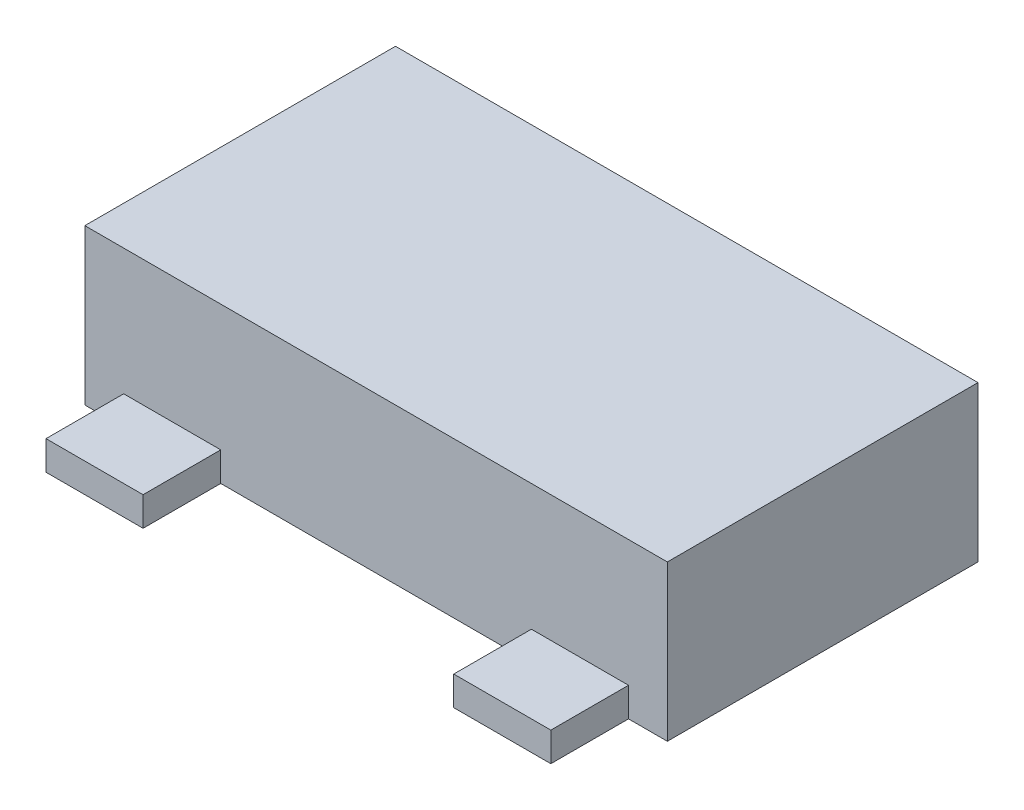
ISO-10303-21;
HEADER;
FILE_DESCRIPTION(('STEP AP214'),'2;1');
FILE_NAME('part.step','',(''),(''),'','','');
FILE_SCHEMA(('AUTOMOTIVE_DESIGN { 1 0 10303 214 1 1 1 1 }'));
ENDSEC;
DATA;
#1=APPLICATION_CONTEXT('core data for automotive mechanical design processes');
#2=APPLICATION_PROTOCOL_DEFINITION('international standard','automotive_design',2000,#1);
#3=PRODUCT_CONTEXT('',#1,'mechanical');
#4=PRODUCT('Part','Part','',(#3));
#5=PRODUCT_RELATED_PRODUCT_CATEGORY('part','',(#4));
#6=PRODUCT_DEFINITION_FORMATION('','',#4);
#7=PRODUCT_DEFINITION_CONTEXT('part definition',#1,'design');
#8=PRODUCT_DEFINITION('design','',#6,#7);
#9=PRODUCT_DEFINITION_SHAPE('','',#8);
#10=(LENGTH_UNIT() NAMED_UNIT(*) SI_UNIT(.MILLI.,.METRE.));
#11=(NAMED_UNIT(*) PLANE_ANGLE_UNIT() SI_UNIT($,.RADIAN.));
#12=(NAMED_UNIT(*) SI_UNIT($,.STERADIAN.) SOLID_ANGLE_UNIT());
#13=UNCERTAINTY_MEASURE_WITH_UNIT(LENGTH_MEASURE(1.E-05),#10,'distance_accuracy_value','');
#14=(GEOMETRIC_REPRESENTATION_CONTEXT(3) GLOBAL_UNCERTAINTY_ASSIGNED_CONTEXT((#13)) GLOBAL_UNIT_ASSIGNED_CONTEXT((#10,
#11,#12)) REPRESENTATION_CONTEXT('',''));
#15=CARTESIAN_POINT('',(0.,0.,0.));
#16=DIRECTION('',(0.,0.,1.));
#17=DIRECTION('',(1.,0.,0.));
#18=AXIS2_PLACEMENT_3D('',#15,#16,#17);
#19=CARTESIAN_POINT('',(-1.5,0.8,0.8));
#20=DIRECTION('',(0.,0.,-1.));
#21=DIRECTION('',(-1.,0.,0.));
#22=AXIS2_PLACEMENT_3D('',#19,#20,#21);
#23=PLANE('',#22);
#24=DIRECTION('',(-1.,0.,0.));
#25=VECTOR('',#24,1.);
#26=CARTESIAN_POINT('',(1.3,0.15,0.8));
#27=LINE('',#26,#25);
#28=CARTESIAN_POINT('',(1.3,0.15,0.8));
#29=VERTEX_POINT('',#28);
#30=CARTESIAN_POINT('',(0.8,0.15,0.8));
#31=VERTEX_POINT('',#30);
#32=EDGE_CURVE('E54',#29,#31,#27,.T.);
#33=ORIENTED_EDGE('',*,*,#32,.F.);
#34=DIRECTION('',(0.,-1.,0.));
#35=VECTOR('',#34,1.);
#36=CARTESIAN_POINT('',(1.3,0.790312423743285,0.8));
#37=LINE('',#36,#35);
#38=CARTESIAN_POINT('',(1.3,0.,0.8));
#39=VERTEX_POINT('',#38);
#40=EDGE_CURVE('E162',#29,#39,#37,.T.);
#41=ORIENTED_EDGE('',*,*,#40,.T.);
#42=DIRECTION('',(1.,0.,0.));
#43=VECTOR('',#42,1.);
#44=CARTESIAN_POINT('',(-1.5,0.,0.8));
#45=LINE('',#44,#43);
#46=CARTESIAN_POINT('',(1.5,0.,0.8));
#47=VERTEX_POINT('',#46);
#48=EDGE_CURVE('E147',#39,#47,#45,.T.);
#49=ORIENTED_EDGE('',*,*,#48,.T.);
#50=DIRECTION('',(0.,-1.,0.));
#51=VECTOR('',#50,1.);
#52=CARTESIAN_POINT('',(1.5,0.8,0.8));
#53=LINE('',#52,#51);
#54=CARTESIAN_POINT('',(1.5,0.8,0.8));
#55=VERTEX_POINT('',#54);
#56=EDGE_CURVE('E249',#55,#47,#53,.T.);
#57=ORIENTED_EDGE('',*,*,#56,.F.);
#58=DIRECTION('',(1.,0.,0.));
#59=VECTOR('',#58,1.);
#60=CARTESIAN_POINT('',(-1.5,0.8,0.8));
#61=LINE('',#60,#59);
#62=CARTESIAN_POINT('',(-1.5,0.8,0.8));
#63=VERTEX_POINT('',#62);
#64=EDGE_CURVE('E247',#63,#55,#61,.T.);
#65=ORIENTED_EDGE('',*,*,#64,.F.);
#66=DIRECTION('',(0.,-1.,0.));
#67=VECTOR('',#66,1.);
#68=CARTESIAN_POINT('',(-1.5,0.8,0.8));
#69=LINE('',#68,#67);
#70=CARTESIAN_POINT('',(-1.5,0.,0.8));
#71=VERTEX_POINT('',#70);
#72=EDGE_CURVE('E258',#63,#71,#69,.T.);
#73=ORIENTED_EDGE('',*,*,#72,.T.);
#74=CARTESIAN_POINT('',(-1.3,0.,0.8));
#75=VERTEX_POINT('',#74);
#76=EDGE_CURVE('E160',#71,#75,#45,.T.);
#77=ORIENTED_EDGE('',*,*,#76,.T.);
#78=DIRECTION('',(0.,-1.,0.));
#79=VECTOR('',#78,1.);
#80=CARTESIAN_POINT('',(-1.3,0.790312423743285,0.8));
#81=LINE('',#80,#79);
#82=CARTESIAN_POINT('',(-1.3,0.15,0.8));
#83=VERTEX_POINT('',#82);
#84=EDGE_CURVE('E205',#83,#75,#81,.T.);
#85=ORIENTED_EDGE('',*,*,#84,.F.);
#86=DIRECTION('',(1.,0.,0.));
#87=VECTOR('',#86,1.);
#88=CARTESIAN_POINT('',(-1.3,0.15,0.8));
#89=LINE('',#88,#87);
#90=CARTESIAN_POINT('',(-0.8,0.15,0.8));
#91=VERTEX_POINT('',#90);
#92=EDGE_CURVE('E191',#83,#91,#89,.T.);
#93=ORIENTED_EDGE('',*,*,#92,.T.);
#94=DIRECTION('',(0.,-1.,0.));
#95=VECTOR('',#94,1.);
#96=CARTESIAN_POINT('',(-0.8,0.790312423743285,0.8));
#97=LINE('',#96,#95);
#98=CARTESIAN_POINT('',(-0.8,0.,0.8));
#99=VERTEX_POINT('',#98);
#100=EDGE_CURVE('E207',#91,#99,#97,.T.);
#101=ORIENTED_EDGE('',*,*,#100,.T.);
#102=CARTESIAN_POINT('',(0.8,0.,0.8));
#103=VERTEX_POINT('',#102);
#104=EDGE_CURVE('E157',#99,#103,#45,.T.);
#105=ORIENTED_EDGE('',*,*,#104,.T.);
#106=DIRECTION('',(0.,-1.,0.));
#107=VECTOR('',#106,1.);
#108=CARTESIAN_POINT('',(0.8,0.790312423743285,0.8));
#109=LINE('',#108,#107);
#110=EDGE_CURVE('E50',#31,#103,#109,.T.);
#111=ORIENTED_EDGE('',*,*,#110,.F.);
#112=EDGE_LOOP('',(#33,#41,#49,#57,#65,#73,#77,#85,#93,#101,#105,#111));
#113=FACE_BOUND('',#112,.T.);
#114=ADVANCED_FACE('F35',(#113),#23,.F.);
#115=CARTESIAN_POINT('',(-1.5,0.8,-0.8));
#116=DIRECTION('',(0.,0.,1.));
#117=DIRECTION('',(1.,0.,0.));
#118=AXIS2_PLACEMENT_3D('',#115,#116,#117);
#119=PLANE('',#118);
#120=DIRECTION('',(0.,-1.,0.));
#121=VECTOR('',#120,1.);
#122=CARTESIAN_POINT('',(0.25,0.15,-0.8));
#123=LINE('',#122,#121);
#124=CARTESIAN_POINT('',(0.25,0.15,-0.8));
#125=VERTEX_POINT('',#124);
#126=CARTESIAN_POINT('',(0.25,0.,-0.8));
#127=VERTEX_POINT('',#126);
#128=EDGE_CURVE('E235',#125,#127,#123,.T.);
#129=ORIENTED_EDGE('',*,*,#128,.F.);
#130=DIRECTION('',(1.,0.,0.));
#131=VECTOR('',#130,1.);
#132=CARTESIAN_POINT('',(-0.25,0.15,-0.8));
#133=LINE('',#132,#131);
#134=CARTESIAN_POINT('',(-0.25,0.15,-0.8));
#135=VERTEX_POINT('',#134);
#136=EDGE_CURVE('E218',#135,#125,#133,.T.);
#137=ORIENTED_EDGE('',*,*,#136,.F.);
#138=DIRECTION('',(0.,-1.,0.));
#139=VECTOR('',#138,1.);
#140=CARTESIAN_POINT('',(-0.25,0.15,-0.8));
#141=LINE('',#140,#139);
#142=CARTESIAN_POINT('',(-0.25,0.,-0.8));
#143=VERTEX_POINT('',#142);
#144=EDGE_CURVE('E237',#135,#143,#141,.T.);
#145=ORIENTED_EDGE('',*,*,#144,.T.);
#146=DIRECTION('',(-1.,0.,0.));
#147=VECTOR('',#146,1.);
#148=CARTESIAN_POINT('',(-1.5,0.,-0.8));
#149=LINE('',#148,#147);
#150=CARTESIAN_POINT('',(-1.5,0.,-0.8));
#151=VERTEX_POINT('',#150);
#152=EDGE_CURVE('E251',#143,#151,#149,.T.);
#153=ORIENTED_EDGE('',*,*,#152,.T.);
#154=DIRECTION('',(0.,-1.,0.));
#155=VECTOR('',#154,1.);
#156=CARTESIAN_POINT('',(-1.5,0.8,-0.8));
#157=LINE('',#156,#155);
#158=CARTESIAN_POINT('',(-1.5,0.8,-0.8));
#159=VERTEX_POINT('',#158);
#160=EDGE_CURVE('E43',#159,#151,#157,.T.);
#161=ORIENTED_EDGE('',*,*,#160,.F.);
#162=DIRECTION('',(-1.,0.,0.));
#163=VECTOR('',#162,1.);
#164=CARTESIAN_POINT('',(-1.5,0.8,-0.8));
#165=LINE('',#164,#163);
#166=CARTESIAN_POINT('',(1.5,0.8,-0.8));
#167=VERTEX_POINT('',#166);
#168=EDGE_CURVE('E243',#167,#159,#165,.T.);
#169=ORIENTED_EDGE('',*,*,#168,.F.);
#170=DIRECTION('',(0.,-1.,0.));
#171=VECTOR('',#170,1.);
#172=CARTESIAN_POINT('',(1.5,0.8,-0.8));
#173=LINE('',#172,#171);
#174=CARTESIAN_POINT('',(1.5,0.,-0.8));
#175=VERTEX_POINT('',#174);
#176=EDGE_CURVE('E11',#167,#175,#173,.T.);
#177=ORIENTED_EDGE('',*,*,#176,.T.);
#178=EDGE_CURVE('E252',#175,#127,#149,.T.);
#179=ORIENTED_EDGE('',*,*,#178,.T.);
#180=EDGE_LOOP('',(#129,#137,#145,#153,#161,#169,#177,#179));
#181=FACE_BOUND('',#180,.T.);
#182=ADVANCED_FACE('F280',(#181),#119,.F.);
#183=CARTESIAN_POINT('',(1.5,0.8,-0.8));
#184=DIRECTION('',(-1.,0.,0.));
#185=DIRECTION('',(0.,0.,1.));
#186=AXIS2_PLACEMENT_3D('',#183,#184,#185);
#187=PLANE('',#186);
#188=DIRECTION('',(0.,0.,-1.));
#189=VECTOR('',#188,1.);
#190=CARTESIAN_POINT('',(1.5,0.,-0.8));
#191=LINE('',#190,#189);
#192=EDGE_CURVE('E154',#47,#175,#191,.T.);
#193=ORIENTED_EDGE('',*,*,#192,.T.);
#194=ORIENTED_EDGE('',*,*,#176,.F.);
#195=DIRECTION('',(0.,0.,-1.));
#196=VECTOR('',#195,1.);
#197=CARTESIAN_POINT('',(1.5,0.8,-0.8));
#198=LINE('',#197,#196);
#199=EDGE_CURVE('E240',#55,#167,#198,.T.);
#200=ORIENTED_EDGE('',*,*,#199,.F.);
#201=ORIENTED_EDGE('',*,*,#56,.T.);
#202=EDGE_LOOP('',(#193,#194,#200,#201));
#203=FACE_BOUND('',#202,.T.);
#204=ADVANCED_FACE('F37',(#203),#187,.F.);
#205=CARTESIAN_POINT('',(-1.5,0.8,-0.8));
#206=DIRECTION('',(1.,0.,0.));
#207=DIRECTION('',(0.,0.,-1.));
#208=AXIS2_PLACEMENT_3D('',#205,#206,#207);
#209=PLANE('',#208);
#210=DIRECTION('',(0.,0.,1.));
#211=VECTOR('',#210,1.);
#212=CARTESIAN_POINT('',(-1.5,0.,-0.8));
#213=LINE('',#212,#211);
#214=EDGE_CURVE('E158',#151,#71,#213,.T.);
#215=ORIENTED_EDGE('',*,*,#214,.T.);
#216=ORIENTED_EDGE('',*,*,#72,.F.);
#217=DIRECTION('',(0.,0.,1.));
#218=VECTOR('',#217,1.);
#219=CARTESIAN_POINT('',(-1.5,0.8,-0.8));
#220=LINE('',#219,#218);
#221=EDGE_CURVE('E245',#159,#63,#220,.T.);
#222=ORIENTED_EDGE('',*,*,#221,.F.);
#223=ORIENTED_EDGE('',*,*,#160,.T.);
#224=EDGE_LOOP('',(#215,#216,#222,#223));
#225=FACE_BOUND('',#224,.T.);
#226=ADVANCED_FACE('F265',(#225),#209,.F.);
#227=CARTESIAN_POINT('',(0.,0.8,0.));
#228=DIRECTION('',(0.,1.,0.));
#229=DIRECTION('',(0.,0.,1.));
#230=AXIS2_PLACEMENT_3D('',#227,#228,#229);
#231=PLANE('',#230);
#232=ORIENTED_EDGE('',*,*,#199,.T.);
#233=ORIENTED_EDGE('',*,*,#168,.T.);
#234=ORIENTED_EDGE('',*,*,#221,.T.);
#235=ORIENTED_EDGE('',*,*,#64,.T.);
#236=EDGE_LOOP('',(#232,#233,#234,#235));
#237=FACE_BOUND('',#236,.T.);
#238=ADVANCED_FACE('F277',(#237),#231,.T.);
#239=CARTESIAN_POINT('',(0.,0.,0.));
#240=DIRECTION('',(0.,1.,0.));
#241=DIRECTION('',(0.,0.,1.));
#242=AXIS2_PLACEMENT_3D('',#239,#240,#241);
#243=PLANE('',#242);
#244=ORIENTED_EDGE('',*,*,#192,.F.);
#245=ORIENTED_EDGE('',*,*,#48,.F.);
#246=DIRECTION('',(0.,0.,1.));
#247=VECTOR('',#246,1.);
#248=CARTESIAN_POINT('',(1.3,0.,0.8));
#249=LINE('',#248,#247);
#250=CARTESIAN_POINT('',(1.3,0.,1.2));
#251=VERTEX_POINT('',#250);
#252=EDGE_CURVE('E151',#39,#251,#249,.T.);
#253=ORIENTED_EDGE('',*,*,#252,.T.);
#254=DIRECTION('',(-1.,0.,0.));
#255=VECTOR('',#254,1.);
#256=CARTESIAN_POINT('',(1.3,0.,1.2));
#257=LINE('',#256,#255);
#258=CARTESIAN_POINT('',(0.8,0.,1.2));
#259=VERTEX_POINT('',#258);
#260=EDGE_CURVE('E173',#251,#259,#257,.T.);
#261=ORIENTED_EDGE('',*,*,#260,.T.);
#262=DIRECTION('',(0.,0.,-1.));
#263=VECTOR('',#262,1.);
#264=CARTESIAN_POINT('',(0.8,0.,0.8));
#265=LINE('',#264,#263);
#266=EDGE_CURVE('E170',#259,#103,#265,.T.);
#267=ORIENTED_EDGE('',*,*,#266,.T.);
#268=ORIENTED_EDGE('',*,*,#104,.F.);
#269=DIRECTION('',(0.,0.,-1.));
#270=VECTOR('',#269,1.);
#271=CARTESIAN_POINT('',(-0.8,0.,0.8));
#272=LINE('',#271,#270);
#273=CARTESIAN_POINT('',(-0.8,0.,1.2));
#274=VERTEX_POINT('',#273);
#275=EDGE_CURVE('E203',#274,#99,#272,.T.);
#276=ORIENTED_EDGE('',*,*,#275,.F.);
#277=DIRECTION('',(1.,0.,0.));
#278=VECTOR('',#277,1.);
#279=CARTESIAN_POINT('',(-1.3,0.,1.2));
#280=LINE('',#279,#278);
#281=CARTESIAN_POINT('',(-1.3,0.,1.2));
#282=VERTEX_POINT('',#281);
#283=EDGE_CURVE('E200',#282,#274,#280,.T.);
#284=ORIENTED_EDGE('',*,*,#283,.F.);
#285=DIRECTION('',(0.,0.,1.));
#286=VECTOR('',#285,1.);
#287=CARTESIAN_POINT('',(-1.3,0.,0.8));
#288=LINE('',#287,#286);
#289=EDGE_CURVE('E186',#75,#282,#288,.T.);
#290=ORIENTED_EDGE('',*,*,#289,.F.);
#291=ORIENTED_EDGE('',*,*,#76,.F.);
#292=ORIENTED_EDGE('',*,*,#214,.F.);
#293=ORIENTED_EDGE('',*,*,#152,.F.);
#294=DIRECTION('',(0.,0.,1.));
#295=VECTOR('',#294,1.);
#296=CARTESIAN_POINT('',(-0.25,0.,-0.8));
#297=LINE('',#296,#295);
#298=CARTESIAN_POINT('',(-0.25,0.,-1.2));
#299=VERTEX_POINT('',#298);
#300=EDGE_CURVE('E197',#299,#143,#297,.T.);
#301=ORIENTED_EDGE('',*,*,#300,.F.);
#302=DIRECTION('',(-1.,0.,0.));
#303=VECTOR('',#302,1.);
#304=CARTESIAN_POINT('',(-0.25,0.,-1.2));
#305=LINE('',#304,#303);
#306=CARTESIAN_POINT('',(0.25,0.,-1.2));
#307=VERTEX_POINT('',#306);
#308=EDGE_CURVE('E219',#307,#299,#305,.T.);
#309=ORIENTED_EDGE('',*,*,#308,.F.);
#310=DIRECTION('',(0.,0.,-1.));
#311=VECTOR('',#310,1.);
#312=CARTESIAN_POINT('',(0.25,0.,-0.8));
#313=LINE('',#312,#311);
#314=EDGE_CURVE('E227',#127,#307,#313,.T.);
#315=ORIENTED_EDGE('',*,*,#314,.F.);
#316=ORIENTED_EDGE('',*,*,#178,.F.);
#317=EDGE_LOOP('',(#244,#245,#253,#261,#267,#268,#276,#284,#290,#291,#292,#293,#301,#309,#315,#316));
#318=FACE_BOUND('',#317,.T.);
#319=ADVANCED_FACE('F148',(#318),#243,.F.);
#320=CARTESIAN_POINT('',(-0.25,0.15,-0.8));
#321=DIRECTION('',(1.,0.,0.));
#322=DIRECTION('',(0.,0.,-1.));
#323=AXIS2_PLACEMENT_3D('',#320,#321,#322);
#324=PLANE('',#323);
#325=ORIENTED_EDGE('',*,*,#300,.T.);
#326=ORIENTED_EDGE('',*,*,#144,.F.);
#327=DIRECTION('',(0.,0.,1.));
#328=VECTOR('',#327,1.);
#329=CARTESIAN_POINT('',(-0.25,0.15,-0.8));
#330=LINE('',#329,#328);
#331=CARTESIAN_POINT('',(-0.25,0.15,-1.2));
#332=VERTEX_POINT('',#331);
#333=EDGE_CURVE('E216',#332,#135,#330,.T.);
#334=ORIENTED_EDGE('',*,*,#333,.F.);
#335=DIRECTION('',(0.,-1.,0.));
#336=VECTOR('',#335,1.);
#337=CARTESIAN_POINT('',(-0.25,0.15,-1.2));
#338=LINE('',#337,#336);
#339=EDGE_CURVE('E225',#332,#299,#338,.T.);
#340=ORIENTED_EDGE('',*,*,#339,.T.);
#341=EDGE_LOOP('',(#325,#326,#334,#340));
#342=FACE_BOUND('',#341,.T.);
#343=ADVANCED_FACE('F295',(#342),#324,.F.);
#344=CARTESIAN_POINT('',(0.25,0.15,-0.8));
#345=DIRECTION('',(-1.,0.,0.));
#346=DIRECTION('',(0.,0.,1.));
#347=AXIS2_PLACEMENT_3D('',#344,#345,#346);
#348=PLANE('',#347);
#349=ORIENTED_EDGE('',*,*,#314,.T.);
#350=DIRECTION('',(0.,-1.,0.));
#351=VECTOR('',#350,1.);
#352=CARTESIAN_POINT('',(0.25,0.15,-1.2));
#353=LINE('',#352,#351);
#354=CARTESIAN_POINT('',(0.25,0.15,-1.2));
#355=VERTEX_POINT('',#354);
#356=EDGE_CURVE('E232',#355,#307,#353,.T.);
#357=ORIENTED_EDGE('',*,*,#356,.F.);
#358=DIRECTION('',(0.,0.,-1.));
#359=VECTOR('',#358,1.);
#360=CARTESIAN_POINT('',(0.25,0.15,-0.8));
#361=LINE('',#360,#359);
#362=EDGE_CURVE('E221',#125,#355,#361,.T.);
#363=ORIENTED_EDGE('',*,*,#362,.F.);
#364=ORIENTED_EDGE('',*,*,#128,.T.);
#365=EDGE_LOOP('',(#349,#357,#363,#364));
#366=FACE_BOUND('',#365,.T.);
#367=ADVANCED_FACE('F300',(#366),#348,.F.);
#368=CARTESIAN_POINT('',(-0.25,0.15,-1.2));
#369=DIRECTION('',(0.,0.,1.));
#370=DIRECTION('',(1.,0.,0.));
#371=AXIS2_PLACEMENT_3D('',#368,#369,#370);
#372=PLANE('',#371);
#373=ORIENTED_EDGE('',*,*,#308,.T.);
#374=ORIENTED_EDGE('',*,*,#339,.F.);
#375=DIRECTION('',(-1.,0.,0.));
#376=VECTOR('',#375,1.);
#377=CARTESIAN_POINT('',(-0.25,0.15,-1.2));
#378=LINE('',#377,#376);
#379=EDGE_CURVE('E223',#355,#332,#378,.T.);
#380=ORIENTED_EDGE('',*,*,#379,.F.);
#381=ORIENTED_EDGE('',*,*,#356,.T.);
#382=EDGE_LOOP('',(#373,#374,#380,#381));
#383=FACE_BOUND('',#382,.T.);
#384=ADVANCED_FACE('F304',(#383),#372,.F.);
#385=CARTESIAN_POINT('',(0.,0.15,0.));
#386=DIRECTION('',(0.,-1.,0.));
#387=DIRECTION('',(0.,0.,-1.));
#388=AXIS2_PLACEMENT_3D('',#385,#386,#387);
#389=PLANE('',#388);
#390=ORIENTED_EDGE('',*,*,#333,.T.);
#391=ORIENTED_EDGE('',*,*,#136,.T.);
#392=ORIENTED_EDGE('',*,*,#362,.T.);
#393=ORIENTED_EDGE('',*,*,#379,.T.);
#394=EDGE_LOOP('',(#390,#391,#392,#393));
#395=FACE_BOUND('',#394,.T.);
#396=ADVANCED_FACE('F308',(#395),#389,.F.);
#397=CARTESIAN_POINT('',(-0.8,0.790312423743285,0.8));
#398=DIRECTION('',(-1.,0.,0.));
#399=DIRECTION('',(0.,0.,1.));
#400=AXIS2_PLACEMENT_3D('',#397,#398,#399);
#401=PLANE('',#400);
#402=ORIENTED_EDGE('',*,*,#100,.F.);
#403=DIRECTION('',(0.,0.,1.));
#404=VECTOR('',#403,1.);
#405=CARTESIAN_POINT('',(-0.8,0.15,0.8));
#406=LINE('',#405,#404);
#407=CARTESIAN_POINT('',(-0.8,0.15,1.2));
#408=VERTEX_POINT('',#407);
#409=EDGE_CURVE('E187',#91,#408,#406,.T.);
#410=ORIENTED_EDGE('',*,*,#409,.T.);
#411=DIRECTION('',(0.,-1.,0.));
#412=VECTOR('',#411,1.);
#413=CARTESIAN_POINT('',(-0.8,0.790312423743285,1.2));
#414=LINE('',#413,#412);
#415=EDGE_CURVE('E210',#408,#274,#414,.T.);
#416=ORIENTED_EDGE('',*,*,#415,.T.);
#417=ORIENTED_EDGE('',*,*,#275,.T.);
#418=EDGE_LOOP('',(#402,#410,#416,#417));
#419=FACE_BOUND('',#418,.T.);
#420=ADVANCED_FACE('F312',(#419),#401,.F.);
#421=CARTESIAN_POINT('',(-1.3,0.790312423743285,1.2));
#422=DIRECTION('',(0.,0.,-1.));
#423=DIRECTION('',(-1.,0.,0.));
#424=AXIS2_PLACEMENT_3D('',#421,#422,#423);
#425=PLANE('',#424);
#426=ORIENTED_EDGE('',*,*,#415,.F.);
#427=DIRECTION('',(-1.,0.,0.));
#428=VECTOR('',#427,1.);
#429=CARTESIAN_POINT('',(-1.3,0.15,1.2));
#430=LINE('',#429,#428);
#431=CARTESIAN_POINT('',(-1.3,0.15,1.2));
#432=VERTEX_POINT('',#431);
#433=EDGE_CURVE('E190',#408,#432,#430,.T.);
#434=ORIENTED_EDGE('',*,*,#433,.T.);
#435=DIRECTION('',(0.,-1.,0.));
#436=VECTOR('',#435,1.);
#437=CARTESIAN_POINT('',(-1.3,0.790312423743285,1.2));
#438=LINE('',#437,#436);
#439=EDGE_CURVE('E212',#432,#282,#438,.T.);
#440=ORIENTED_EDGE('',*,*,#439,.T.);
#441=ORIENTED_EDGE('',*,*,#283,.T.);
#442=EDGE_LOOP('',(#426,#434,#440,#441));
#443=FACE_BOUND('',#442,.T.);
#444=ADVANCED_FACE('F318',(#443),#425,.F.);
#445=CARTESIAN_POINT('',(-1.3,0.790312423743285,0.8));
#446=DIRECTION('',(1.,0.,0.));
#447=DIRECTION('',(0.,0.,-1.));
#448=AXIS2_PLACEMENT_3D('',#445,#446,#447);
#449=PLANE('',#448);
#450=ORIENTED_EDGE('',*,*,#439,.F.);
#451=DIRECTION('',(0.,0.,-1.));
#452=VECTOR('',#451,1.);
#453=CARTESIAN_POINT('',(-1.3,0.15,0.8));
#454=LINE('',#453,#452);
#455=EDGE_CURVE('E194',#432,#83,#454,.T.);
#456=ORIENTED_EDGE('',*,*,#455,.T.);
#457=ORIENTED_EDGE('',*,*,#84,.T.);
#458=ORIENTED_EDGE('',*,*,#289,.T.);
#459=EDGE_LOOP('',(#450,#456,#457,#458));
#460=FACE_BOUND('',#459,.T.);
#461=ADVANCED_FACE('F314',(#460),#449,.F.);
#462=CARTESIAN_POINT('',(0.,0.15,0.));
#463=DIRECTION('',(0.,-1.,0.));
#464=DIRECTION('',(0.,0.,-1.));
#465=AXIS2_PLACEMENT_3D('',#462,#463,#464);
#466=PLANE('',#465);
#467=ORIENTED_EDGE('',*,*,#433,.F.);
#468=ORIENTED_EDGE('',*,*,#409,.F.);
#469=ORIENTED_EDGE('',*,*,#92,.F.);
#470=ORIENTED_EDGE('',*,*,#455,.F.);
#471=EDGE_LOOP('',(#467,#468,#469,#470));
#472=FACE_BOUND('',#471,.T.);
#473=ADVANCED_FACE('F317',(#472),#466,.F.);
#474=CARTESIAN_POINT('',(1.3,0.790312423743285,0.8));
#475=DIRECTION('',(1.,0.,0.));
#476=DIRECTION('',(0.,0.,-1.));
#477=AXIS2_PLACEMENT_3D('',#474,#475,#476);
#478=PLANE('',#477);
#479=DIRECTION('',(0.,0.,-1.));
#480=VECTOR('',#479,1.);
#481=CARTESIAN_POINT('',(1.3,0.15,0.8));
#482=LINE('',#481,#480);
#483=CARTESIAN_POINT('',(1.3,0.15,1.2));
#484=VERTEX_POINT('',#483);
#485=EDGE_CURVE('E176',#484,#29,#482,.T.);
#486=ORIENTED_EDGE('',*,*,#485,.F.);
#487=DIRECTION('',(0.,-1.,0.));
#488=VECTOR('',#487,1.);
#489=CARTESIAN_POINT('',(1.3,0.790312423743285,1.2));
#490=LINE('',#489,#488);
#491=EDGE_CURVE('E169',#484,#251,#490,.T.);
#492=ORIENTED_EDGE('',*,*,#491,.T.);
#493=ORIENTED_EDGE('',*,*,#252,.F.);
#494=ORIENTED_EDGE('',*,*,#40,.F.);
#495=EDGE_LOOP('',(#486,#492,#493,#494));
#496=FACE_BOUND('',#495,.T.);
#497=ADVANCED_FACE('F167',(#496),#478,.T.);
#498=CARTESIAN_POINT('',(0.8,0.790312423743285,0.8));
#499=DIRECTION('',(-1.,0.,0.));
#500=DIRECTION('',(0.,0.,1.));
#501=AXIS2_PLACEMENT_3D('',#498,#499,#500);
#502=PLANE('',#501);
#503=DIRECTION('',(0.,0.,1.));
#504=VECTOR('',#503,1.);
#505=CARTESIAN_POINT('',(0.8,0.15,0.8));
#506=LINE('',#505,#504);
#507=CARTESIAN_POINT('',(0.8,0.15,1.2));
#508=VERTEX_POINT('',#507);
#509=EDGE_CURVE('E165',#31,#508,#506,.T.);
#510=ORIENTED_EDGE('',*,*,#509,.F.);
#511=ORIENTED_EDGE('',*,*,#110,.T.);
#512=ORIENTED_EDGE('',*,*,#266,.F.);
#513=DIRECTION('',(0.,-1.,0.));
#514=VECTOR('',#513,1.);
#515=CARTESIAN_POINT('',(0.8,0.790312423743285,1.2));
#516=LINE('',#515,#514);
#517=EDGE_CURVE('E181',#508,#259,#516,.T.);
#518=ORIENTED_EDGE('',*,*,#517,.F.);
#519=EDGE_LOOP('',(#510,#511,#512,#518));
#520=FACE_BOUND('',#519,.T.);
#521=ADVANCED_FACE('F331',(#520),#502,.T.);
#522=CARTESIAN_POINT('',(1.3,0.790312423743285,1.2));
#523=DIRECTION('',(0.,0.,1.));
#524=DIRECTION('',(1.,0.,0.));
#525=AXIS2_PLACEMENT_3D('',#522,#523,#524);
#526=PLANE('',#525);
#527=DIRECTION('',(1.,0.,0.));
#528=VECTOR('',#527,1.);
#529=CARTESIAN_POINT('',(1.3,0.15,1.2));
#530=LINE('',#529,#528);
#531=EDGE_CURVE('E184',#508,#484,#530,.T.);
#532=ORIENTED_EDGE('',*,*,#531,.F.);
#533=ORIENTED_EDGE('',*,*,#517,.T.);
#534=ORIENTED_EDGE('',*,*,#260,.F.);
#535=ORIENTED_EDGE('',*,*,#491,.F.);
#536=EDGE_LOOP('',(#532,#533,#534,#535));
#537=FACE_BOUND('',#536,.T.);
#538=ADVANCED_FACE('F334',(#537),#526,.T.);
#539=CARTESIAN_POINT('',(0.,0.15,0.));
#540=DIRECTION('',(0.,-1.,0.));
#541=DIRECTION('',(0.,0.,-1.));
#542=AXIS2_PLACEMENT_3D('',#539,#540,#541);
#543=PLANE('',#542);
#544=ORIENTED_EDGE('',*,*,#485,.T.);
#545=ORIENTED_EDGE('',*,*,#32,.T.);
#546=ORIENTED_EDGE('',*,*,#509,.T.);
#547=ORIENTED_EDGE('',*,*,#531,.T.);
#548=EDGE_LOOP('',(#544,#545,#546,#547));
#549=FACE_BOUND('',#548,.T.);
#550=ADVANCED_FACE('F338',(#549),#543,.F.);
#551=CLOSED_SHELL('',(#114,#182,#204,#226,#238,#319,#343,#367,#384,#396,#420,#444,#461,#473,
#497,#521,#538,#550));
#552=MANIFOLD_SOLID_BREP('B2',#551);
#553=ADVANCED_BREP_SHAPE_REPRESENTATION('',(#18,#552),#14);
#554=SHAPE_DEFINITION_REPRESENTATION(#9,#553);
ENDSEC;
END-ISO-10303-21;
